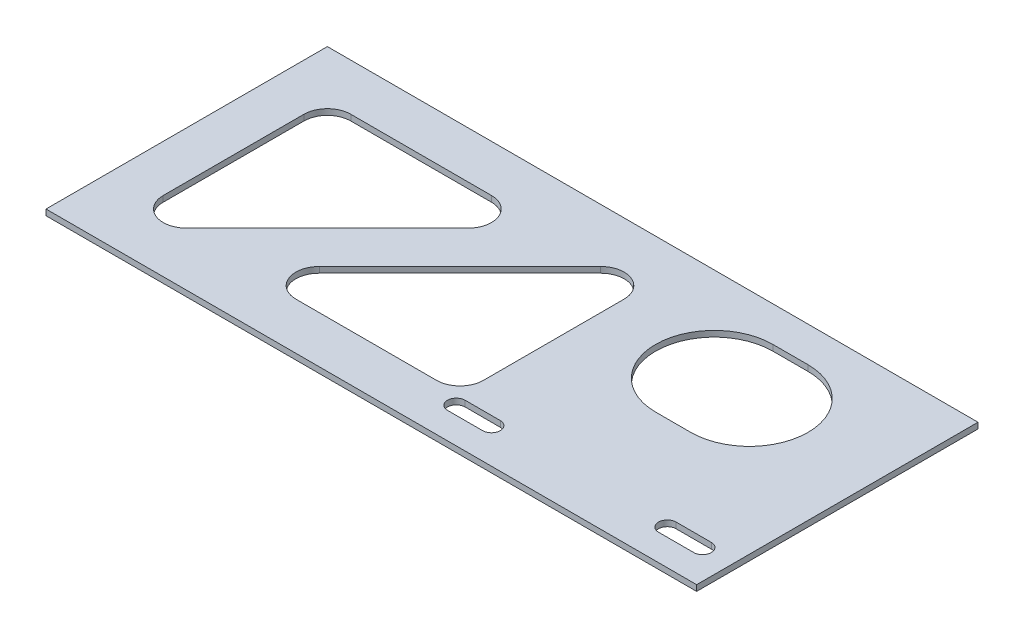
ISO-10303-21;
HEADER;
FILE_DESCRIPTION(('STEP AP214'),'2;1');
FILE_NAME('part.step','',(''),(''),'','','');
FILE_SCHEMA(('AUTOMOTIVE_DESIGN { 1 0 10303 214 1 1 1 1 }'));
ENDSEC;
DATA;
#1=APPLICATION_CONTEXT('core data for automotive mechanical design processes');
#2=APPLICATION_PROTOCOL_DEFINITION('international standard','automotive_design',2000,#1);
#3=PRODUCT_CONTEXT('',#1,'mechanical');
#4=PRODUCT('Part','Part','',(#3));
#5=PRODUCT_RELATED_PRODUCT_CATEGORY('part','',(#4));
#6=PRODUCT_DEFINITION_FORMATION('','',#4);
#7=PRODUCT_DEFINITION_CONTEXT('part definition',#1,'design');
#8=PRODUCT_DEFINITION('design','',#6,#7);
#9=PRODUCT_DEFINITION_SHAPE('','',#8);
#10=(LENGTH_UNIT() NAMED_UNIT(*) SI_UNIT(.MILLI.,.METRE.));
#11=(NAMED_UNIT(*) PLANE_ANGLE_UNIT() SI_UNIT($,.RADIAN.));
#12=(NAMED_UNIT(*) SI_UNIT($,.STERADIAN.) SOLID_ANGLE_UNIT());
#13=UNCERTAINTY_MEASURE_WITH_UNIT(LENGTH_MEASURE(1.E-05),#10,'distance_accuracy_value','');
#14=(GEOMETRIC_REPRESENTATION_CONTEXT(3) GLOBAL_UNCERTAINTY_ASSIGNED_CONTEXT((#13)) GLOBAL_UNIT_ASSIGNED_CONTEXT((#10,
#11,#12)) REPRESENTATION_CONTEXT('',''));
#15=CARTESIAN_POINT('',(0.,0.,0.));
#16=DIRECTION('',(0.,0.,1.));
#17=DIRECTION('',(1.,0.,0.));
#18=AXIS2_PLACEMENT_3D('',#15,#16,#17);
#19=CARTESIAN_POINT('',(-176.2125,1.58750000000001,76.2000000000001));
#20=DIRECTION('',(0.,-1.,0.));
#21=DIRECTION('',(0.,0.,-1.));
#22=AXIS2_PLACEMENT_3D('',#19,#20,#21);
#23=PLANE('',#22);
#24=DIRECTION('',(-1.,0.,0.));
#25=VECTOR('',#24,1.);
#26=CARTESIAN_POINT('',(46.0375,1.58750000000001,52.3875000000001));
#27=LINE('',#26,#25);
#28=CARTESIAN_POINT('',(46.0375,1.58750000000001,52.3875000000001));
#29=VERTEX_POINT('',#28);
#30=CARTESIAN_POINT('',(26.9875,1.58750000000001,52.3875000000001));
#31=VERTEX_POINT('',#30);
#32=EDGE_CURVE('E292',#29,#31,#27,.T.);
#33=ORIENTED_EDGE('',*,*,#32,.F.);
#34=CARTESIAN_POINT('',(46.0375,1.58750000000001,57.1500000000001));
#35=DIRECTION('',(0.,1.,0.));
#36=DIRECTION('',(0.,0.,1.));
#37=AXIS2_PLACEMENT_3D('',#34,#35,#36);
#38=CIRCLE('',#37,4.76249999999999);
#39=CARTESIAN_POINT('',(46.0375,1.58750000000001,61.9125000000001));
#40=VERTEX_POINT('',#39);
#41=EDGE_CURVE('E95',#40,#29,#38,.T.);
#42=ORIENTED_EDGE('',*,*,#41,.F.);
#43=DIRECTION('',(1.,0.,0.));
#44=VECTOR('',#43,1.);
#45=CARTESIAN_POINT('',(46.0375,1.58750000000001,61.9125000000001));
#46=LINE('',#45,#44);
#47=CARTESIAN_POINT('',(26.9875,1.58750000000001,61.9125000000001));
#48=VERTEX_POINT('',#47);
#49=EDGE_CURVE('E283',#48,#40,#46,.T.);
#50=ORIENTED_EDGE('',*,*,#49,.F.);
#51=CARTESIAN_POINT('',(26.9875,1.58750000000001,57.1500000000001));
#52=DIRECTION('',(0.,1.,0.));
#53=DIRECTION('',(0.,0.,1.));
#54=AXIS2_PLACEMENT_3D('',#51,#52,#53);
#55=CIRCLE('',#54,4.76249999999999);
#56=EDGE_CURVE('E286',#31,#48,#55,.T.);
#57=ORIENTED_EDGE('',*,*,#56,.F.);
#58=EDGE_LOOP('',(#33,#42,#50,#57));
#59=FACE_BOUND('',#58,.T.);
#60=DIRECTION('',(-1.,0.,0.));
#61=VECTOR('',#60,1.);
#62=CARTESIAN_POINT('',(160.3375,1.58750000000001,52.3875000000001));
#63=LINE('',#62,#61);
#64=CARTESIAN_POINT('',(160.3375,1.58750000000001,52.3875000000001));
#65=VERTEX_POINT('',#64);
#66=CARTESIAN_POINT('',(141.2875,1.58750000000001,52.3875000000001));
#67=VERTEX_POINT('',#66);
#68=EDGE_CURVE('E317',#65,#67,#63,.T.);
#69=ORIENTED_EDGE('',*,*,#68,.F.);
#70=CARTESIAN_POINT('',(160.3375,1.58750000000001,57.1500000000001));
#71=DIRECTION('',(0.,1.,0.));
#72=DIRECTION('',(0.,0.,1.));
#73=AXIS2_PLACEMENT_3D('',#70,#71,#72);
#74=CIRCLE('',#73,4.7625);
#75=CARTESIAN_POINT('',(160.3375,1.58750000000001,61.9125000000001));
#76=VERTEX_POINT('',#75);
#77=EDGE_CURVE('E298',#76,#65,#74,.T.);
#78=ORIENTED_EDGE('',*,*,#77,.F.);
#79=DIRECTION('',(1.,0.,0.));
#80=VECTOR('',#79,1.);
#81=CARTESIAN_POINT('',(160.3375,1.58750000000001,61.9125000000001));
#82=LINE('',#81,#80);
#83=CARTESIAN_POINT('',(141.2875,1.58750000000001,61.9125000000001));
#84=VERTEX_POINT('',#83);
#85=EDGE_CURVE('E306',#84,#76,#82,.T.);
#86=ORIENTED_EDGE('',*,*,#85,.F.);
#87=CARTESIAN_POINT('',(141.2875,1.58750000000001,57.1500000000001));
#88=DIRECTION('',(0.,1.,0.));
#89=DIRECTION('',(0.,0.,1.));
#90=AXIS2_PLACEMENT_3D('',#87,#88,#89);
#91=CIRCLE('',#90,4.7625);
#92=EDGE_CURVE('E320',#67,#84,#91,.T.);
#93=ORIENTED_EDGE('',*,*,#92,.F.);
#94=EDGE_LOOP('',(#69,#78,#86,#93));
#95=FACE_BOUND('',#94,.T.);
#96=DIRECTION('',(0.,0.,1.));
#97=VECTOR('',#96,1.);
#98=CARTESIAN_POINT('',(-176.2125,1.58750000000001,-76.1999999999999));
#99=LINE('',#98,#97);
#100=CARTESIAN_POINT('',(-176.2125,1.58750000000001,-76.1999999999999));
#101=VERTEX_POINT('',#100);
#102=CARTESIAN_POINT('',(-176.2125,1.58750000000001,76.2000000000001));
#103=VERTEX_POINT('',#102);
#104=EDGE_CURVE('E459',#101,#103,#99,.T.);
#105=ORIENTED_EDGE('',*,*,#104,.T.);
#106=DIRECTION('',(1.,0.,0.));
#107=VECTOR('',#106,1.);
#108=CARTESIAN_POINT('',(176.2125,1.58750000000001,76.2));
#109=LINE('',#108,#107);
#110=CARTESIAN_POINT('',(176.2125,1.58750000000001,76.2));
#111=VERTEX_POINT('',#110);
#112=EDGE_CURVE('E462',#103,#111,#109,.T.);
#113=ORIENTED_EDGE('',*,*,#112,.T.);
#114=DIRECTION('',(0.,0.,-1.));
#115=VECTOR('',#114,1.);
#116=CARTESIAN_POINT('',(176.2125,1.58750000000001,-76.2));
#117=LINE('',#116,#115);
#118=CARTESIAN_POINT('',(176.2125,1.58750000000001,-76.2));
#119=VERTEX_POINT('',#118);
#120=EDGE_CURVE('E465',#111,#119,#117,.T.);
#121=ORIENTED_EDGE('',*,*,#120,.T.);
#122=DIRECTION('',(-1.,0.,0.));
#123=VECTOR('',#122,1.);
#124=CARTESIAN_POINT('',(176.2125,1.58750000000001,-76.2));
#125=LINE('',#124,#123);
#126=EDGE_CURVE('E467',#119,#101,#125,.T.);
#127=ORIENTED_EDGE('',*,*,#126,.T.);
#128=EDGE_LOOP('',(#105,#113,#121,#127));
#129=FACE_BOUND('',#128,.T.);
#130=CARTESIAN_POINT('',(84.1375,1.58750000000001,-25.4));
#131=DIRECTION('',(0.,1.,0.));
#132=DIRECTION('',(0.,0.,1.));
#133=AXIS2_PLACEMENT_3D('',#130,#131,#132);
#134=CIRCLE('',#133,31.75);
#135=CARTESIAN_POINT('',(84.1375,1.58750000000001,-57.15));
#136=VERTEX_POINT('',#135);
#137=CARTESIAN_POINT('',(84.1375,1.58750000000001,6.35000000000001));
#138=VERTEX_POINT('',#137);
#139=EDGE_CURVE('E442',#136,#138,#134,.T.);
#140=ORIENTED_EDGE('',*,*,#139,.F.);
#141=DIRECTION('',(-1.,0.,0.));
#142=VECTOR('',#141,1.);
#143=CARTESIAN_POINT('',(-298.796121768143,1.58750000000001,-57.1499999999999));
#144=LINE('',#143,#142);
#145=CARTESIAN_POINT('',(103.1875,1.58750000000001,-57.15));
#146=VERTEX_POINT('',#145);
#147=EDGE_CURVE('E416',#146,#136,#144,.T.);
#148=ORIENTED_EDGE('',*,*,#147,.F.);
#149=CARTESIAN_POINT('',(103.1875,1.58750000000001,-25.4));
#150=DIRECTION('',(0.,1.,0.));
#151=DIRECTION('',(0.,0.,1.));
#152=AXIS2_PLACEMENT_3D('',#149,#150,#151);
#153=CIRCLE('',#152,31.75);
#154=CARTESIAN_POINT('',(103.1875,1.58750000000001,6.35000000000002));
#155=VERTEX_POINT('',#154);
#156=EDGE_CURVE('E431',#155,#146,#153,.T.);
#157=ORIENTED_EDGE('',*,*,#156,.F.);
#158=DIRECTION('',(-1.,0.,0.));
#159=VECTOR('',#158,1.);
#160=CARTESIAN_POINT('',(-298.796121768143,1.58750000000001,6.34999999999999));
#161=LINE('',#160,#159);
#162=EDGE_CURVE('E445',#155,#138,#161,.T.);
#163=ORIENTED_EDGE('',*,*,#162,.T.);
#164=EDGE_LOOP('',(#140,#148,#157,#163));
#165=FACE_BOUND('',#164,.T.);
#166=CARTESIAN_POINT('',(-66.2704510314472,1.58750000000001,38.1000000000001));
#167=DIRECTION('',(0.,1.,0.));
#168=DIRECTION('',(0.,0.,1.));
#169=AXIS2_PLACEMENT_3D('',#166,#167,#168);
#170=CIRCLE('',#169,12.7);
#171=CARTESIAN_POINT('',(-75.2507071525164,1.58750000000001,29.1197438789309));
#172=VERTEX_POINT('',#171);
#173=CARTESIAN_POINT('',(-66.2704510314472,1.58750000000001,50.8000000000001));
#174=VERTEX_POINT('',#173);
#175=EDGE_CURVE('E400',#172,#174,#170,.T.);
#176=ORIENTED_EDGE('',*,*,#175,.F.);
#177=DIRECTION('',(-0.707106781186544,0.,0.707106781186551));
#178=VECTOR('',#177,1.);
#179=CARTESIAN_POINT('',(-172.463542520863,1.58750000000001,126.332579247279));
#180=LINE('',#179,#178);
#181=CARTESIAN_POINT('',(0.949292847482852,1.58750000000001,-47.0802561210691));
#182=VERTEX_POINT('',#181);
#183=EDGE_CURVE('E368',#182,#172,#180,.T.);
#184=ORIENTED_EDGE('',*,*,#183,.F.);
#185=CARTESIAN_POINT('',(9.92954896855206,1.58750000000001,-38.1));
#186=DIRECTION('',(0.,1.,0.));
#187=DIRECTION('',(0.,0.,1.));
#188=AXIS2_PLACEMENT_3D('',#185,#186,#187);
#189=CIRCLE('',#188,12.7);
#190=CARTESIAN_POINT('',(22.6295489685521,1.58750000000001,-38.1));
#191=VERTEX_POINT('',#190);
#192=EDGE_CURVE('E383',#191,#182,#189,.T.);
#193=ORIENTED_EDGE('',*,*,#192,.F.);
#194=DIRECTION('',(0.,0.,-1.));
#195=VECTOR('',#194,1.);
#196=CARTESIAN_POINT('',(22.6295489685521,1.58750000000001,0.));
#197=LINE('',#196,#195);
#198=CARTESIAN_POINT('',(22.6295489685521,1.58750000000001,38.1000000000001));
#199=VERTEX_POINT('',#198);
#200=EDGE_CURVE('E409',#199,#191,#197,.T.);
#201=ORIENTED_EDGE('',*,*,#200,.F.);
#202=CARTESIAN_POINT('',(9.92954896855206,1.58750000000001,38.1000000000001));
#203=DIRECTION('',(0.,1.,0.));
#204=DIRECTION('',(0.,0.,1.));
#205=AXIS2_PLACEMENT_3D('',#202,#203,#204);
#206=CIRCLE('',#205,12.7);
#207=CARTESIAN_POINT('',(9.92954896855208,1.58750000000001,50.8));
#208=VERTEX_POINT('',#207);
#209=EDGE_CURVE('E406',#208,#199,#206,.T.);
#210=ORIENTED_EDGE('',*,*,#209,.F.);
#211=DIRECTION('',(1.,0.,0.));
#212=VECTOR('',#211,1.);
#213=CARTESIAN_POINT('',(-298.796121768143,1.58750000000001,50.8000000000001));
#214=LINE('',#213,#212);
#215=EDGE_CURVE('E403',#174,#208,#214,.T.);
#216=ORIENTED_EDGE('',*,*,#215,.F.);
#217=EDGE_LOOP('',(#176,#184,#193,#201,#210,#216));
#218=FACE_BOUND('',#217,.T.);
#219=CARTESIAN_POINT('',(-138.1125,1.58750000000001,-38.1));
#220=DIRECTION('',(0.,1.,0.));
#221=DIRECTION('',(0.,0.,1.));
#222=AXIS2_PLACEMENT_3D('',#219,#220,#221);
#223=CIRCLE('',#222,12.7);
#224=CARTESIAN_POINT('',(-150.8125,1.58750000000001,-38.1));
#225=VERTEX_POINT('',#224);
#226=CARTESIAN_POINT('',(-138.1125,1.58750000000001,-50.8));
#227=VERTEX_POINT('',#226);
#228=EDGE_CURVE('E327',#225,#227,#223,.F.);
#229=ORIENTED_EDGE('',*,*,#228,.T.);
#230=DIRECTION('',(1.,0.,0.));
#231=VECTOR('',#230,1.);
#232=CARTESIAN_POINT('',(-298.796121768143,1.58750000000001,-50.8));
#233=LINE('',#232,#231);
#234=CARTESIAN_POINT('',(-61.9125000000008,1.58750000000001,-50.8));
#235=VERTEX_POINT('',#234);
#236=EDGE_CURVE('E337',#227,#235,#233,.T.);
#237=ORIENTED_EDGE('',*,*,#236,.T.);
#238=CARTESIAN_POINT('',(-61.9125000000008,1.58750000000001,-38.1));
#239=DIRECTION('',(0.,1.,0.));
#240=DIRECTION('',(0.,0.,1.));
#241=AXIS2_PLACEMENT_3D('',#238,#239,#240);
#242=CIRCLE('',#241,12.7);
#243=CARTESIAN_POINT('',(-52.9322438789316,1.58750000000001,-29.1197438789309));
#244=VERTEX_POINT('',#243);
#245=EDGE_CURVE('E360',#235,#244,#242,.F.);
#246=ORIENTED_EDGE('',*,*,#245,.T.);
#247=DIRECTION('',(-0.707106781186544,0.,0.707106781186551));
#248=VECTOR('',#247,1.);
#249=CARTESIAN_POINT('',(-190.424054763001,1.58750000000001,108.37206700514));
#250=LINE('',#249,#248);
#251=CARTESIAN_POINT('',(-129.132243878931,1.58750000000001,47.0802561210692));
#252=VERTEX_POINT('',#251);
#253=EDGE_CURVE('E357',#244,#252,#250,.T.);
#254=ORIENTED_EDGE('',*,*,#253,.T.);
#255=CARTESIAN_POINT('',(-138.1125,1.58750000000001,38.1000000000001));
#256=DIRECTION('',(0.,1.,0.));
#257=DIRECTION('',(0.,0.,1.));
#258=AXIS2_PLACEMENT_3D('',#255,#256,#257);
#259=CIRCLE('',#258,12.7);
#260=CARTESIAN_POINT('',(-150.8125,1.58750000000001,38.1000000000001));
#261=VERTEX_POINT('',#260);
#262=EDGE_CURVE('E354',#252,#261,#259,.F.);
#263=ORIENTED_EDGE('',*,*,#262,.T.);
#264=DIRECTION('',(0.,0.,-1.));
#265=VECTOR('',#264,1.);
#266=CARTESIAN_POINT('',(-150.8125,1.58750000000001,0.));
#267=LINE('',#266,#265);
#268=EDGE_CURVE('E351',#261,#225,#267,.T.);
#269=ORIENTED_EDGE('',*,*,#268,.T.);
#270=EDGE_LOOP('',(#229,#237,#246,#254,#263,#269));
#271=FACE_BOUND('',#270,.T.);
#272=ADVANCED_FACE('F80',(#59,#95,#129,#165,#218,#271),#23,.F.);
#273=CARTESIAN_POINT('',(-176.2125,-1.58750000000001,76.2000000000001));
#274=DIRECTION('',(0.,-1.,0.));
#275=DIRECTION('',(0.,0.,-1.));
#276=AXIS2_PLACEMENT_3D('',#273,#274,#275);
#277=PLANE('',#276);
#278=CARTESIAN_POINT('',(46.0375,-1.58750000000001,57.1500000000001));
#279=DIRECTION('',(0.,1.,0.));
#280=DIRECTION('',(0.,0.,1.));
#281=AXIS2_PLACEMENT_3D('',#278,#279,#280);
#282=CIRCLE('',#281,4.76249999999999);
#283=CARTESIAN_POINT('',(46.0375,-1.58750000000001,61.9125000000001));
#284=VERTEX_POINT('',#283);
#285=CARTESIAN_POINT('',(46.0375,-1.58750000000001,52.3875000000001));
#286=VERTEX_POINT('',#285);
#287=EDGE_CURVE('E267',#284,#286,#282,.T.);
#288=ORIENTED_EDGE('',*,*,#287,.T.);
#289=DIRECTION('',(-1.,0.,0.));
#290=VECTOR('',#289,1.);
#291=CARTESIAN_POINT('',(46.0375,-1.58750000000001,52.3875000000001));
#292=LINE('',#291,#290);
#293=CARTESIAN_POINT('',(26.9875,-1.58750000000001,52.3875000000001));
#294=VERTEX_POINT('',#293);
#295=EDGE_CURVE('E276',#286,#294,#292,.T.);
#296=ORIENTED_EDGE('',*,*,#295,.T.);
#297=CARTESIAN_POINT('',(26.9875,-1.58750000000001,57.1500000000001));
#298=DIRECTION('',(0.,1.,0.));
#299=DIRECTION('',(0.,0.,1.));
#300=AXIS2_PLACEMENT_3D('',#297,#298,#299);
#301=CIRCLE('',#300,4.76249999999999);
#302=CARTESIAN_POINT('',(26.9875,-1.58750000000001,61.9125000000001));
#303=VERTEX_POINT('',#302);
#304=EDGE_CURVE('E103',#294,#303,#301,.T.);
#305=ORIENTED_EDGE('',*,*,#304,.T.);
#306=DIRECTION('',(1.,0.,0.));
#307=VECTOR('',#306,1.);
#308=CARTESIAN_POINT('',(46.0375,-1.58750000000001,61.9125000000001));
#309=LINE('',#308,#307);
#310=EDGE_CURVE('E273',#303,#284,#309,.T.);
#311=ORIENTED_EDGE('',*,*,#310,.T.);
#312=EDGE_LOOP('',(#288,#296,#305,#311));
#313=FACE_BOUND('',#312,.T.);
#314=CARTESIAN_POINT('',(160.3375,-1.58750000000001,57.1500000000001));
#315=DIRECTION('',(0.,1.,0.));
#316=DIRECTION('',(0.,0.,1.));
#317=AXIS2_PLACEMENT_3D('',#314,#315,#316);
#318=CIRCLE('',#317,4.7625);
#319=CARTESIAN_POINT('',(160.3375,-1.58750000000001,61.9125000000001));
#320=VERTEX_POINT('',#319);
#321=CARTESIAN_POINT('',(160.3375,-1.58750000000001,52.3875000000001));
#322=VERTEX_POINT('',#321);
#323=EDGE_CURVE('E302',#320,#322,#318,.T.);
#324=ORIENTED_EDGE('',*,*,#323,.T.);
#325=DIRECTION('',(-1.,0.,0.));
#326=VECTOR('',#325,1.);
#327=CARTESIAN_POINT('',(160.3375,-1.58750000000001,52.3875000000001));
#328=LINE('',#327,#326);
#329=CARTESIAN_POINT('',(141.2875,-1.58750000000001,52.3875000000001));
#330=VERTEX_POINT('',#329);
#331=EDGE_CURVE('E305',#322,#330,#328,.T.);
#332=ORIENTED_EDGE('',*,*,#331,.T.);
#333=CARTESIAN_POINT('',(141.2875,-1.58750000000001,57.1500000000001));
#334=DIRECTION('',(0.,1.,0.));
#335=DIRECTION('',(0.,0.,1.));
#336=AXIS2_PLACEMENT_3D('',#333,#334,#335);
#337=CIRCLE('',#336,4.7625);
#338=CARTESIAN_POINT('',(141.2875,-1.58750000000001,61.9125000000001));
#339=VERTEX_POINT('',#338);
#340=EDGE_CURVE('E309',#330,#339,#337,.T.);
#341=ORIENTED_EDGE('',*,*,#340,.T.);
#342=DIRECTION('',(1.,0.,0.));
#343=VECTOR('',#342,1.);
#344=CARTESIAN_POINT('',(160.3375,-1.58750000000001,61.9125000000001));
#345=LINE('',#344,#343);
#346=EDGE_CURVE('E312',#339,#320,#345,.T.);
#347=ORIENTED_EDGE('',*,*,#346,.T.);
#348=EDGE_LOOP('',(#324,#332,#341,#347));
#349=FACE_BOUND('',#348,.T.);
#350=DIRECTION('',(0.,0.,1.));
#351=VECTOR('',#350,1.);
#352=CARTESIAN_POINT('',(-176.2125,-1.58750000000001,-76.1999999999999));
#353=LINE('',#352,#351);
#354=CARTESIAN_POINT('',(-176.2125,-1.58750000000001,-76.1999999999999));
#355=VERTEX_POINT('',#354);
#356=CARTESIAN_POINT('',(-176.2125,-1.58750000000001,76.2000000000001));
#357=VERTEX_POINT('',#356);
#358=EDGE_CURVE('E452',#355,#357,#353,.T.);
#359=ORIENTED_EDGE('',*,*,#358,.F.);
#360=DIRECTION('',(-1.,0.,0.));
#361=VECTOR('',#360,1.);
#362=CARTESIAN_POINT('',(176.2125,-1.58750000000001,-76.2));
#363=LINE('',#362,#361);
#364=CARTESIAN_POINT('',(176.2125,-1.58750000000001,-76.2));
#365=VERTEX_POINT('',#364);
#366=EDGE_CURVE('E463',#365,#355,#363,.T.);
#367=ORIENTED_EDGE('',*,*,#366,.F.);
#368=DIRECTION('',(0.,0.,-1.));
#369=VECTOR('',#368,1.);
#370=CARTESIAN_POINT('',(176.2125,-1.58750000000001,-76.2));
#371=LINE('',#370,#369);
#372=CARTESIAN_POINT('',(176.2125,-1.58750000000001,76.2));
#373=VERTEX_POINT('',#372);
#374=EDGE_CURVE('E474',#373,#365,#371,.T.);
#375=ORIENTED_EDGE('',*,*,#374,.F.);
#376=DIRECTION('',(1.,0.,0.));
#377=VECTOR('',#376,1.);
#378=CARTESIAN_POINT('',(176.2125,-1.58750000000001,76.2));
#379=LINE('',#378,#377);
#380=EDGE_CURVE('E472',#357,#373,#379,.T.);
#381=ORIENTED_EDGE('',*,*,#380,.F.);
#382=EDGE_LOOP('',(#359,#367,#375,#381));
#383=FACE_BOUND('',#382,.T.);
#384=DIRECTION('',(-1.,0.,0.));
#385=VECTOR('',#384,1.);
#386=CARTESIAN_POINT('',(-298.796121768143,-1.58750000000001,-57.1499999999999));
#387=LINE('',#386,#385);
#388=CARTESIAN_POINT('',(103.1875,-1.58750000000001,-57.15));
#389=VERTEX_POINT('',#388);
#390=CARTESIAN_POINT('',(84.1375,-1.58750000000001,-57.15));
#391=VERTEX_POINT('',#390);
#392=EDGE_CURVE('E427',#389,#391,#387,.T.);
#393=ORIENTED_EDGE('',*,*,#392,.T.);
#394=CARTESIAN_POINT('',(84.1375,-1.58750000000001,-25.4));
#395=DIRECTION('',(0.,1.,0.));
#396=DIRECTION('',(0.,0.,1.));
#397=AXIS2_PLACEMENT_3D('',#394,#395,#396);
#398=CIRCLE('',#397,31.75);
#399=CARTESIAN_POINT('',(84.1375,-1.58750000000001,6.35000000000002));
#400=VERTEX_POINT('',#399);
#401=EDGE_CURVE('E430',#391,#400,#398,.T.);
#402=ORIENTED_EDGE('',*,*,#401,.T.);
#403=DIRECTION('',(-1.,0.,0.));
#404=VECTOR('',#403,1.);
#405=CARTESIAN_POINT('',(-298.796121768143,-1.58750000000001,6.34999999999999));
#406=LINE('',#405,#404);
#407=CARTESIAN_POINT('',(103.1875,-1.58750000000001,6.35000000000002));
#408=VERTEX_POINT('',#407);
#409=EDGE_CURVE('E434',#408,#400,#406,.T.);
#410=ORIENTED_EDGE('',*,*,#409,.F.);
#411=CARTESIAN_POINT('',(103.1875,-1.58750000000001,-25.4));
#412=DIRECTION('',(0.,1.,0.));
#413=DIRECTION('',(0.,0.,1.));
#414=AXIS2_PLACEMENT_3D('',#411,#412,#413);
#415=CIRCLE('',#414,31.75);
#416=EDGE_CURVE('E437',#408,#389,#415,.T.);
#417=ORIENTED_EDGE('',*,*,#416,.T.);
#418=EDGE_LOOP('',(#393,#402,#410,#417));
#419=FACE_BOUND('',#418,.T.);
#420=DIRECTION('',(-0.707106781186544,0.,0.707106781186551));
#421=VECTOR('',#420,1.);
#422=CARTESIAN_POINT('',(-172.463542520863,-1.58750000000001,126.332579247279));
#423=LINE('',#422,#421);
#424=CARTESIAN_POINT('',(0.949292847482852,-1.58750000000001,-47.0802561210691));
#425=VERTEX_POINT('',#424);
#426=CARTESIAN_POINT('',(-75.2507071525164,-1.58750000000001,29.119743878931));
#427=VERTEX_POINT('',#426);
#428=EDGE_CURVE('E379',#425,#427,#423,.T.);
#429=ORIENTED_EDGE('',*,*,#428,.T.);
#430=CARTESIAN_POINT('',(-66.2704510314472,-1.58750000000001,38.1000000000001));
#431=DIRECTION('',(0.,1.,0.));
#432=DIRECTION('',(0.,0.,1.));
#433=AXIS2_PLACEMENT_3D('',#430,#431,#432);
#434=CIRCLE('',#433,12.7);
#435=CARTESIAN_POINT('',(-66.2704510314472,-1.58750000000001,50.8000000000001));
#436=VERTEX_POINT('',#435);
#437=EDGE_CURVE('E382',#427,#436,#434,.T.);
#438=ORIENTED_EDGE('',*,*,#437,.T.);
#439=DIRECTION('',(1.,0.,0.));
#440=VECTOR('',#439,1.);
#441=CARTESIAN_POINT('',(-298.796121768143,-1.58750000000001,50.8000000000001));
#442=LINE('',#441,#440);
#443=CARTESIAN_POINT('',(9.92954896855208,-1.58750000000001,50.8));
#444=VERTEX_POINT('',#443);
#445=EDGE_CURVE('E386',#436,#444,#442,.T.);
#446=ORIENTED_EDGE('',*,*,#445,.T.);
#447=CARTESIAN_POINT('',(9.92954896855206,-1.58750000000001,38.1000000000001));
#448=DIRECTION('',(0.,1.,0.));
#449=DIRECTION('',(0.,0.,1.));
#450=AXIS2_PLACEMENT_3D('',#447,#448,#449);
#451=CIRCLE('',#450,12.7);
#452=CARTESIAN_POINT('',(22.6295489685521,-1.58750000000001,38.1000000000001));
#453=VERTEX_POINT('',#452);
#454=EDGE_CURVE('E389',#444,#453,#451,.T.);
#455=ORIENTED_EDGE('',*,*,#454,.T.);
#456=DIRECTION('',(0.,0.,-1.));
#457=VECTOR('',#456,1.);
#458=CARTESIAN_POINT('',(22.6295489685521,-1.58750000000001,0.));
#459=LINE('',#458,#457);
#460=CARTESIAN_POINT('',(22.6295489685521,-1.58750000000001,-38.1));
#461=VERTEX_POINT('',#460);
#462=EDGE_CURVE('E392',#453,#461,#459,.T.);
#463=ORIENTED_EDGE('',*,*,#462,.T.);
#464=CARTESIAN_POINT('',(9.92954896855206,-1.58750000000001,-38.1));
#465=DIRECTION('',(0.,1.,0.));
#466=DIRECTION('',(0.,0.,1.));
#467=AXIS2_PLACEMENT_3D('',#464,#465,#466);
#468=CIRCLE('',#467,12.7);
#469=EDGE_CURVE('E395',#461,#425,#468,.T.);
#470=ORIENTED_EDGE('',*,*,#469,.T.);
#471=EDGE_LOOP('',(#429,#438,#446,#455,#463,#470));
#472=FACE_BOUND('',#471,.T.);
#473=DIRECTION('',(1.,0.,0.));
#474=VECTOR('',#473,1.);
#475=CARTESIAN_POINT('',(-298.796121768143,-1.58750000000001,-50.8));
#476=LINE('',#475,#474);
#477=CARTESIAN_POINT('',(-138.1125,-1.58750000000001,-50.8));
#478=VERTEX_POINT('',#477);
#479=CARTESIAN_POINT('',(-61.9125000000008,-1.58750000000001,-50.8));
#480=VERTEX_POINT('',#479);
#481=EDGE_CURVE('E346',#478,#480,#476,.T.);
#482=ORIENTED_EDGE('',*,*,#481,.F.);
#483=CARTESIAN_POINT('',(-138.1125,-1.58750000000001,-38.1));
#484=DIRECTION('',(0.,1.,0.));
#485=DIRECTION('',(0.,0.,1.));
#486=AXIS2_PLACEMENT_3D('',#483,#484,#485);
#487=CIRCLE('',#486,12.7);
#488=CARTESIAN_POINT('',(-150.8125,-1.58750000000001,-38.1));
#489=VERTEX_POINT('',#488);
#490=EDGE_CURVE('E334',#489,#478,#487,.F.);
#491=ORIENTED_EDGE('',*,*,#490,.F.);
#492=DIRECTION('',(0.,0.,-1.));
#493=VECTOR('',#492,1.);
#494=CARTESIAN_POINT('',(-150.8125,-1.58750000000001,0.));
#495=LINE('',#494,#493);
#496=CARTESIAN_POINT('',(-150.8125,-1.58750000000001,38.1000000000001));
#497=VERTEX_POINT('',#496);
#498=EDGE_CURVE('E336',#497,#489,#495,.T.);
#499=ORIENTED_EDGE('',*,*,#498,.F.);
#500=CARTESIAN_POINT('',(-138.1125,-1.58750000000001,38.1000000000001));
#501=DIRECTION('',(0.,1.,0.));
#502=DIRECTION('',(0.,0.,1.));
#503=AXIS2_PLACEMENT_3D('',#500,#501,#502);
#504=CIRCLE('',#503,12.7);
#505=CARTESIAN_POINT('',(-129.132243878931,-1.58750000000001,47.0802561210692));
#506=VERTEX_POINT('',#505);
#507=EDGE_CURVE('E339',#506,#497,#504,.F.);
#508=ORIENTED_EDGE('',*,*,#507,.F.);
#509=DIRECTION('',(-0.707106781186544,0.,0.707106781186551));
#510=VECTOR('',#509,1.);
#511=CARTESIAN_POINT('',(-190.424054763001,-1.58750000000001,108.37206700514));
#512=LINE('',#511,#510);
#513=CARTESIAN_POINT('',(-52.9322438789316,-1.58750000000001,-29.1197438789309));
#514=VERTEX_POINT('',#513);
#515=EDGE_CURVE('E342',#514,#506,#512,.T.);
#516=ORIENTED_EDGE('',*,*,#515,.F.);
#517=CARTESIAN_POINT('',(-61.9125000000008,-1.58750000000001,-38.1));
#518=DIRECTION('',(0.,1.,0.));
#519=DIRECTION('',(0.,0.,1.));
#520=AXIS2_PLACEMENT_3D('',#517,#518,#519);
#521=CIRCLE('',#520,12.7);
#522=EDGE_CURVE('E344',#480,#514,#521,.F.);
#523=ORIENTED_EDGE('',*,*,#522,.F.);
#524=EDGE_LOOP('',(#482,#491,#499,#508,#516,#523));
#525=FACE_BOUND('',#524,.T.);
#526=ADVANCED_FACE('F280',(#313,#349,#383,#419,#472,#525),#277,.T.);
#527=CARTESIAN_POINT('',(-176.2125,1.58750000000001,-76.1999999999999));
#528=DIRECTION('',(1.,0.,0.));
#529=DIRECTION('',(0.,0.,-1.));
#530=AXIS2_PLACEMENT_3D('',#527,#528,#529);
#531=PLANE('',#530);
#532=ORIENTED_EDGE('',*,*,#358,.T.);
#533=DIRECTION('',(0.,-1.,0.));
#534=VECTOR('',#533,1.);
#535=CARTESIAN_POINT('',(-176.2125,1.58750000000001,76.2000000000001));
#536=LINE('',#535,#534);
#537=EDGE_CURVE('E14',#103,#357,#536,.T.);
#538=ORIENTED_EDGE('',*,*,#537,.F.);
#539=ORIENTED_EDGE('',*,*,#104,.F.);
#540=DIRECTION('',(0.,-1.,0.));
#541=VECTOR('',#540,1.);
#542=CARTESIAN_POINT('',(-176.2125,1.58750000000001,-76.1999999999999));
#543=LINE('',#542,#541);
#544=EDGE_CURVE('E469',#101,#355,#543,.T.);
#545=ORIENTED_EDGE('',*,*,#544,.T.);
#546=EDGE_LOOP('',(#532,#538,#539,#545));
#547=FACE_BOUND('',#546,.T.);
#548=ADVANCED_FACE('F82',(#547),#531,.F.);
#549=CARTESIAN_POINT('',(176.2125,1.58750000000001,76.2));
#550=DIRECTION('',(0.,0.,-1.));
#551=DIRECTION('',(-1.,0.,0.));
#552=AXIS2_PLACEMENT_3D('',#549,#550,#551);
#553=PLANE('',#552);
#554=ORIENTED_EDGE('',*,*,#380,.T.);
#555=DIRECTION('',(0.,-1.,0.));
#556=VECTOR('',#555,1.);
#557=CARTESIAN_POINT('',(176.2125,1.58750000000001,76.2));
#558=LINE('',#557,#556);
#559=EDGE_CURVE('E88',#111,#373,#558,.T.);
#560=ORIENTED_EDGE('',*,*,#559,.F.);
#561=ORIENTED_EDGE('',*,*,#112,.F.);
#562=ORIENTED_EDGE('',*,*,#537,.T.);
#563=EDGE_LOOP('',(#554,#560,#561,#562));
#564=FACE_BOUND('',#563,.T.);
#565=ADVANCED_FACE('F502',(#564),#553,.F.);
#566=CARTESIAN_POINT('',(176.2125,1.58750000000001,-76.2));
#567=DIRECTION('',(-1.,0.,0.));
#568=DIRECTION('',(0.,0.,1.));
#569=AXIS2_PLACEMENT_3D('',#566,#567,#568);
#570=PLANE('',#569);
#571=ORIENTED_EDGE('',*,*,#374,.T.);
#572=DIRECTION('',(0.,-1.,0.));
#573=VECTOR('',#572,1.);
#574=CARTESIAN_POINT('',(176.2125,1.58750000000001,-76.2));
#575=LINE('',#574,#573);
#576=EDGE_CURVE('E479',#119,#365,#575,.T.);
#577=ORIENTED_EDGE('',*,*,#576,.F.);
#578=ORIENTED_EDGE('',*,*,#120,.F.);
#579=ORIENTED_EDGE('',*,*,#559,.T.);
#580=EDGE_LOOP('',(#571,#577,#578,#579));
#581=FACE_BOUND('',#580,.T.);
#582=ADVANCED_FACE('F486',(#581),#570,.F.);
#583=CARTESIAN_POINT('',(176.2125,1.58750000000001,-76.2));
#584=DIRECTION('',(0.,0.,1.));
#585=DIRECTION('',(1.,0.,0.));
#586=AXIS2_PLACEMENT_3D('',#583,#584,#585);
#587=PLANE('',#586);
#588=ORIENTED_EDGE('',*,*,#366,.T.);
#589=ORIENTED_EDGE('',*,*,#544,.F.);
#590=ORIENTED_EDGE('',*,*,#126,.F.);
#591=ORIENTED_EDGE('',*,*,#576,.T.);
#592=EDGE_LOOP('',(#588,#589,#590,#591));
#593=FACE_BOUND('',#592,.T.);
#594=ADVANCED_FACE('F495',(#593),#587,.F.);
#595=CARTESIAN_POINT('',(-298.796121768143,-1.58750000000001,-57.1499999999999));
#596=DIRECTION('',(0.,0.,-1.));
#597=DIRECTION('',(-1.,0.,0.));
#598=AXIS2_PLACEMENT_3D('',#595,#596,#597);
#599=PLANE('',#598);
#600=ORIENTED_EDGE('',*,*,#147,.T.);
#601=DIRECTION('',(0.,1.,0.));
#602=VECTOR('',#601,1.);
#603=CARTESIAN_POINT('',(84.1375,-1.58750000000001,-57.15));
#604=LINE('',#603,#602);
#605=EDGE_CURVE('E440',#391,#136,#604,.T.);
#606=ORIENTED_EDGE('',*,*,#605,.F.);
#607=ORIENTED_EDGE('',*,*,#392,.F.);
#608=DIRECTION('',(0.,1.,0.));
#609=VECTOR('',#608,1.);
#610=CARTESIAN_POINT('',(103.1875,-1.58750000000001,-57.15));
#611=LINE('',#610,#609);
#612=EDGE_CURVE('E450',#389,#146,#611,.T.);
#613=ORIENTED_EDGE('',*,*,#612,.T.);
#614=EDGE_LOOP('',(#600,#606,#607,#613));
#615=FACE_BOUND('',#614,.T.);
#616=ADVANCED_FACE('F518',(#615),#599,.F.);
#617=CARTESIAN_POINT('',(103.1875,-1.58750000000001,-25.4));
#618=DIRECTION('',(0.,1.,0.));
#619=DIRECTION('',(0.,0.,1.));
#620=AXIS2_PLACEMENT_3D('',#617,#618,#619);
#621=CYLINDRICAL_SURFACE('',#620,31.75);
#622=ORIENTED_EDGE('',*,*,#156,.T.);
#623=ORIENTED_EDGE('',*,*,#612,.F.);
#624=ORIENTED_EDGE('',*,*,#416,.F.);
#625=DIRECTION('',(0.,1.,0.));
#626=VECTOR('',#625,1.);
#627=CARTESIAN_POINT('',(103.1875,-1.58750000000001,6.35000000000002));
#628=LINE('',#627,#626);
#629=EDGE_CURVE('E453',#408,#155,#628,.T.);
#630=ORIENTED_EDGE('',*,*,#629,.T.);
#631=EDGE_LOOP('',(#622,#623,#624,#630));
#632=FACE_BOUND('',#631,.T.);
#633=ADVANCED_FACE('F525',(#632),#621,.F.);
#634=CARTESIAN_POINT('',(-298.796121768143,-1.58750000000001,6.34999999999999));
#635=DIRECTION('',(0.,0.,-1.));
#636=DIRECTION('',(-1.,0.,0.));
#637=AXIS2_PLACEMENT_3D('',#634,#635,#636);
#638=PLANE('',#637);
#639=ORIENTED_EDGE('',*,*,#162,.F.);
#640=ORIENTED_EDGE('',*,*,#629,.F.);
#641=ORIENTED_EDGE('',*,*,#409,.T.);
#642=DIRECTION('',(0.,1.,0.));
#643=VECTOR('',#642,1.);
#644=CARTESIAN_POINT('',(84.1375,-1.58750000000001,6.35000000000001));
#645=LINE('',#644,#643);
#646=EDGE_CURVE('E455',#400,#138,#645,.T.);
#647=ORIENTED_EDGE('',*,*,#646,.T.);
#648=EDGE_LOOP('',(#639,#640,#641,#647));
#649=FACE_BOUND('',#648,.T.);
#650=ADVANCED_FACE('F530',(#649),#638,.T.);
#651=CARTESIAN_POINT('',(84.1375,-1.58750000000001,-25.4));
#652=DIRECTION('',(0.,1.,0.));
#653=DIRECTION('',(0.,0.,1.));
#654=AXIS2_PLACEMENT_3D('',#651,#652,#653);
#655=CYLINDRICAL_SURFACE('',#654,31.75);
#656=ORIENTED_EDGE('',*,*,#139,.T.);
#657=ORIENTED_EDGE('',*,*,#646,.F.);
#658=ORIENTED_EDGE('',*,*,#401,.F.);
#659=ORIENTED_EDGE('',*,*,#605,.T.);
#660=EDGE_LOOP('',(#656,#657,#658,#659));
#661=FACE_BOUND('',#660,.T.);
#662=ADVANCED_FACE('F539',(#661),#655,.F.);
#663=CARTESIAN_POINT('',(-172.463542520863,-1.58750000000001,126.332579247279));
#664=DIRECTION('',(-0.707106781186551,0.,-0.707106781186544));
#665=DIRECTION('',(-0.707106781186544,0.,0.707106781186551));
#666=AXIS2_PLACEMENT_3D('',#663,#664,#665);
#667=PLANE('',#666);
#668=ORIENTED_EDGE('',*,*,#183,.T.);
#669=DIRECTION('',(0.,1.,0.));
#670=VECTOR('',#669,1.);
#671=CARTESIAN_POINT('',(-75.2507071525164,-1.58750000000001,29.119743878931));
#672=LINE('',#671,#670);
#673=EDGE_CURVE('E398',#427,#172,#672,.T.);
#674=ORIENTED_EDGE('',*,*,#673,.F.);
#675=ORIENTED_EDGE('',*,*,#428,.F.);
#676=DIRECTION('',(0.,1.,0.));
#677=VECTOR('',#676,1.);
#678=CARTESIAN_POINT('',(0.949292847482852,-1.58750000000001,-47.0802561210691));
#679=LINE('',#678,#677);
#680=EDGE_CURVE('E414',#425,#182,#679,.T.);
#681=ORIENTED_EDGE('',*,*,#680,.T.);
#682=EDGE_LOOP('',(#668,#674,#675,#681));
#683=FACE_BOUND('',#682,.T.);
#684=ADVANCED_FACE('F596',(#683),#667,.F.);
#685=CARTESIAN_POINT('',(9.92954896855206,-1.58750000000001,-38.1));
#686=DIRECTION('',(0.,1.,0.));
#687=DIRECTION('',(0.,0.,1.));
#688=AXIS2_PLACEMENT_3D('',#685,#686,#687);
#689=CYLINDRICAL_SURFACE('',#688,12.7);
#690=ORIENTED_EDGE('',*,*,#192,.T.);
#691=ORIENTED_EDGE('',*,*,#680,.F.);
#692=ORIENTED_EDGE('',*,*,#469,.F.);
#693=DIRECTION('',(0.,1.,0.));
#694=VECTOR('',#693,1.);
#695=CARTESIAN_POINT('',(22.6295489685521,-1.58750000000001,-38.1));
#696=LINE('',#695,#694);
#697=EDGE_CURVE('E417',#461,#191,#696,.T.);
#698=ORIENTED_EDGE('',*,*,#697,.T.);
#699=EDGE_LOOP('',(#690,#691,#692,#698));
#700=FACE_BOUND('',#699,.T.);
#701=ADVANCED_FACE('F592',(#700),#689,.F.);
#702=CARTESIAN_POINT('',(22.6295489685521,-1.58750000000001,0.));
#703=DIRECTION('',(1.,0.,0.));
#704=DIRECTION('',(0.,0.,-1.));
#705=AXIS2_PLACEMENT_3D('',#702,#703,#704);
#706=PLANE('',#705);
#707=ORIENTED_EDGE('',*,*,#200,.T.);
#708=ORIENTED_EDGE('',*,*,#697,.F.);
#709=ORIENTED_EDGE('',*,*,#462,.F.);
#710=DIRECTION('',(0.,1.,0.));
#711=VECTOR('',#710,1.);
#712=CARTESIAN_POINT('',(22.6295489685521,-1.58750000000001,38.1000000000001));
#713=LINE('',#712,#711);
#714=EDGE_CURVE('E419',#453,#199,#713,.T.);
#715=ORIENTED_EDGE('',*,*,#714,.T.);
#716=EDGE_LOOP('',(#707,#708,#709,#715));
#717=FACE_BOUND('',#716,.T.);
#718=ADVANCED_FACE('F595',(#717),#706,.F.);
#719=CARTESIAN_POINT('',(9.92954896855206,-1.58750000000001,38.1000000000001));
#720=DIRECTION('',(0.,1.,0.));
#721=DIRECTION('',(0.,0.,1.));
#722=AXIS2_PLACEMENT_3D('',#719,#720,#721);
#723=CYLINDRICAL_SURFACE('',#722,12.7);
#724=ORIENTED_EDGE('',*,*,#209,.T.);
#725=ORIENTED_EDGE('',*,*,#714,.F.);
#726=ORIENTED_EDGE('',*,*,#454,.F.);
#727=DIRECTION('',(0.,1.,0.));
#728=VECTOR('',#727,1.);
#729=CARTESIAN_POINT('',(9.92954896855208,-1.58750000000001,50.8));
#730=LINE('',#729,#728);
#731=EDGE_CURVE('E421',#444,#208,#730,.T.);
#732=ORIENTED_EDGE('',*,*,#731,.T.);
#733=EDGE_LOOP('',(#724,#725,#726,#732));
#734=FACE_BOUND('',#733,.T.);
#735=ADVANCED_FACE('F600',(#734),#723,.F.);
#736=CARTESIAN_POINT('',(-298.796121768143,-1.58750000000001,50.8000000000001));
#737=DIRECTION('',(0.,0.,1.));
#738=DIRECTION('',(1.,0.,0.));
#739=AXIS2_PLACEMENT_3D('',#736,#737,#738);
#740=PLANE('',#739);
#741=ORIENTED_EDGE('',*,*,#215,.T.);
#742=ORIENTED_EDGE('',*,*,#731,.F.);
#743=ORIENTED_EDGE('',*,*,#445,.F.);
#744=DIRECTION('',(0.,1.,0.));
#745=VECTOR('',#744,1.);
#746=CARTESIAN_POINT('',(-66.2704510314472,-1.58750000000001,50.8000000000001));
#747=LINE('',#746,#745);
#748=EDGE_CURVE('E423',#436,#174,#747,.T.);
#749=ORIENTED_EDGE('',*,*,#748,.T.);
#750=EDGE_LOOP('',(#741,#742,#743,#749));
#751=FACE_BOUND('',#750,.T.);
#752=ADVANCED_FACE('F604',(#751),#740,.F.);
#753=CARTESIAN_POINT('',(-66.2704510314472,-1.58750000000001,38.1000000000001));
#754=DIRECTION('',(0.,1.,0.));
#755=DIRECTION('',(0.,0.,1.));
#756=AXIS2_PLACEMENT_3D('',#753,#754,#755);
#757=CYLINDRICAL_SURFACE('',#756,12.7);
#758=ORIENTED_EDGE('',*,*,#175,.T.);
#759=ORIENTED_EDGE('',*,*,#748,.F.);
#760=ORIENTED_EDGE('',*,*,#437,.F.);
#761=ORIENTED_EDGE('',*,*,#673,.T.);
#762=EDGE_LOOP('',(#758,#759,#760,#761));
#763=FACE_BOUND('',#762,.T.);
#764=ADVANCED_FACE('F591',(#763),#757,.F.);
#765=CARTESIAN_POINT('',(-138.1125,-1.58750000000001,-38.1));
#766=DIRECTION('',(0.,1.,0.));
#767=DIRECTION('',(0.,0.,1.));
#768=AXIS2_PLACEMENT_3D('',#765,#766,#767);
#769=CYLINDRICAL_SURFACE('',#768,12.7);
#770=ORIENTED_EDGE('',*,*,#228,.F.);
#771=DIRECTION('',(0.,1.,0.));
#772=VECTOR('',#771,1.);
#773=CARTESIAN_POINT('',(-150.8125,-1.58750000000001,-38.1));
#774=LINE('',#773,#772);
#775=EDGE_CURVE('E348',#489,#225,#774,.T.);
#776=ORIENTED_EDGE('',*,*,#775,.F.);
#777=ORIENTED_EDGE('',*,*,#490,.T.);
#778=DIRECTION('',(0.,1.,0.));
#779=VECTOR('',#778,1.);
#780=CARTESIAN_POINT('',(-138.1125,-1.58750000000001,-50.8));
#781=LINE('',#780,#779);
#782=EDGE_CURVE('E365',#478,#227,#781,.T.);
#783=ORIENTED_EDGE('',*,*,#782,.T.);
#784=EDGE_LOOP('',(#770,#776,#777,#783));
#785=FACE_BOUND('',#784,.T.);
#786=ADVANCED_FACE('F564',(#785),#769,.F.);
#787=CARTESIAN_POINT('',(-298.796121768143,-1.58750000000001,-50.8));
#788=DIRECTION('',(0.,0.,1.));
#789=DIRECTION('',(1.,0.,0.));
#790=AXIS2_PLACEMENT_3D('',#787,#788,#789);
#791=PLANE('',#790);
#792=ORIENTED_EDGE('',*,*,#236,.F.);
#793=ORIENTED_EDGE('',*,*,#782,.F.);
#794=ORIENTED_EDGE('',*,*,#481,.T.);
#795=DIRECTION('',(0.,1.,0.));
#796=VECTOR('',#795,1.);
#797=CARTESIAN_POINT('',(-61.9125000000008,-1.58750000000001,-50.8));
#798=LINE('',#797,#796);
#799=EDGE_CURVE('E369',#480,#235,#798,.T.);
#800=ORIENTED_EDGE('',*,*,#799,.T.);
#801=EDGE_LOOP('',(#792,#793,#794,#800));
#802=FACE_BOUND('',#801,.T.);
#803=ADVANCED_FACE('F556',(#802),#791,.T.);
#804=CARTESIAN_POINT('',(-61.9125000000008,-1.58750000000001,-38.1));
#805=DIRECTION('',(0.,1.,0.));
#806=DIRECTION('',(0.,0.,1.));
#807=AXIS2_PLACEMENT_3D('',#804,#805,#806);
#808=CYLINDRICAL_SURFACE('',#807,12.7);
#809=ORIENTED_EDGE('',*,*,#245,.F.);
#810=ORIENTED_EDGE('',*,*,#799,.F.);
#811=ORIENTED_EDGE('',*,*,#522,.T.);
#812=DIRECTION('',(0.,1.,0.));
#813=VECTOR('',#812,1.);
#814=CARTESIAN_POINT('',(-52.9322438789316,-1.58750000000001,-29.1197438789309));
#815=LINE('',#814,#813);
#816=EDGE_CURVE('E371',#514,#244,#815,.T.);
#817=ORIENTED_EDGE('',*,*,#816,.T.);
#818=EDGE_LOOP('',(#809,#810,#811,#817));
#819=FACE_BOUND('',#818,.T.);
#820=ADVANCED_FACE('F559',(#819),#808,.F.);
#821=CARTESIAN_POINT('',(-190.424054763001,-1.58750000000001,108.37206700514));
#822=DIRECTION('',(-0.707106781186551,0.,-0.707106781186544));
#823=DIRECTION('',(-0.707106781186544,0.,0.707106781186551));
#824=AXIS2_PLACEMENT_3D('',#821,#822,#823);
#825=PLANE('',#824);
#826=ORIENTED_EDGE('',*,*,#253,.F.);
#827=ORIENTED_EDGE('',*,*,#816,.F.);
#828=ORIENTED_EDGE('',*,*,#515,.T.);
#829=DIRECTION('',(0.,1.,0.));
#830=VECTOR('',#829,1.);
#831=CARTESIAN_POINT('',(-129.132243878931,-1.58750000000001,47.0802561210692));
#832=LINE('',#831,#830);
#833=EDGE_CURVE('E373',#506,#252,#832,.T.);
#834=ORIENTED_EDGE('',*,*,#833,.T.);
#835=EDGE_LOOP('',(#826,#827,#828,#834));
#836=FACE_BOUND('',#835,.T.);
#837=ADVANCED_FACE('F575',(#836),#825,.T.);
#838=CARTESIAN_POINT('',(-138.1125,-1.58750000000001,38.1000000000001));
#839=DIRECTION('',(0.,1.,0.));
#840=DIRECTION('',(0.,0.,1.));
#841=AXIS2_PLACEMENT_3D('',#838,#839,#840);
#842=CYLINDRICAL_SURFACE('',#841,12.7);
#843=ORIENTED_EDGE('',*,*,#262,.F.);
#844=ORIENTED_EDGE('',*,*,#833,.F.);
#845=ORIENTED_EDGE('',*,*,#507,.T.);
#846=DIRECTION('',(0.,1.,0.));
#847=VECTOR('',#846,1.);
#848=CARTESIAN_POINT('',(-150.8125,-1.58750000000001,38.1000000000001));
#849=LINE('',#848,#847);
#850=EDGE_CURVE('E375',#497,#261,#849,.T.);
#851=ORIENTED_EDGE('',*,*,#850,.T.);
#852=EDGE_LOOP('',(#843,#844,#845,#851));
#853=FACE_BOUND('',#852,.T.);
#854=ADVANCED_FACE('F572',(#853),#842,.F.);
#855=CARTESIAN_POINT('',(-150.8125,-1.58750000000001,0.));
#856=DIRECTION('',(1.,0.,0.));
#857=DIRECTION('',(0.,0.,-1.));
#858=AXIS2_PLACEMENT_3D('',#855,#856,#857);
#859=PLANE('',#858);
#860=ORIENTED_EDGE('',*,*,#268,.F.);
#861=ORIENTED_EDGE('',*,*,#850,.F.);
#862=ORIENTED_EDGE('',*,*,#498,.T.);
#863=ORIENTED_EDGE('',*,*,#775,.T.);
#864=EDGE_LOOP('',(#860,#861,#862,#863));
#865=FACE_BOUND('',#864,.T.);
#866=ADVANCED_FACE('F568',(#865),#859,.T.);
#867=CARTESIAN_POINT('',(160.3375,-1.58750000000001,57.1500000000001));
#868=DIRECTION('',(0.,1.,0.));
#869=DIRECTION('',(0.,0.,1.));
#870=AXIS2_PLACEMENT_3D('',#867,#868,#869);
#871=CYLINDRICAL_SURFACE('',#870,4.7625);
#872=ORIENTED_EDGE('',*,*,#77,.T.);
#873=DIRECTION('',(0.,1.,0.));
#874=VECTOR('',#873,1.);
#875=CARTESIAN_POINT('',(160.3375,-1.58750000000001,52.3875000000001));
#876=LINE('',#875,#874);
#877=EDGE_CURVE('E315',#322,#65,#876,.T.);
#878=ORIENTED_EDGE('',*,*,#877,.F.);
#879=ORIENTED_EDGE('',*,*,#323,.F.);
#880=DIRECTION('',(0.,1.,0.));
#881=VECTOR('',#880,1.);
#882=CARTESIAN_POINT('',(160.3375,-1.58750000000001,61.9125000000001));
#883=LINE('',#882,#881);
#884=EDGE_CURVE('E325',#320,#76,#883,.T.);
#885=ORIENTED_EDGE('',*,*,#884,.T.);
#886=EDGE_LOOP('',(#872,#878,#879,#885));
#887=FACE_BOUND('',#886,.T.);
#888=ADVANCED_FACE('F588',(#887),#871,.F.);
#889=CARTESIAN_POINT('',(160.3375,-1.58750000000001,61.9125000000001));
#890=DIRECTION('',(0.,0.,1.));
#891=DIRECTION('',(1.,0.,0.));
#892=AXIS2_PLACEMENT_3D('',#889,#890,#891);
#893=PLANE('',#892);
#894=ORIENTED_EDGE('',*,*,#85,.T.);
#895=ORIENTED_EDGE('',*,*,#884,.F.);
#896=ORIENTED_EDGE('',*,*,#346,.F.);
#897=DIRECTION('',(0.,1.,0.));
#898=VECTOR('',#897,1.);
#899=CARTESIAN_POINT('',(141.2875,-1.58750000000001,61.9125000000001));
#900=LINE('',#899,#898);
#901=EDGE_CURVE('E328',#339,#84,#900,.T.);
#902=ORIENTED_EDGE('',*,*,#901,.T.);
#903=EDGE_LOOP('',(#894,#895,#896,#902));
#904=FACE_BOUND('',#903,.T.);
#905=ADVANCED_FACE('F675',(#904),#893,.F.);
#906=CARTESIAN_POINT('',(141.2875,-1.58750000000001,57.1500000000001));
#907=DIRECTION('',(0.,1.,0.));
#908=DIRECTION('',(0.,0.,1.));
#909=AXIS2_PLACEMENT_3D('',#906,#907,#908);
#910=CYLINDRICAL_SURFACE('',#909,4.7625);
#911=ORIENTED_EDGE('',*,*,#92,.T.);
#912=ORIENTED_EDGE('',*,*,#901,.F.);
#913=ORIENTED_EDGE('',*,*,#340,.F.);
#914=DIRECTION('',(0.,1.,0.));
#915=VECTOR('',#914,1.);
#916=CARTESIAN_POINT('',(141.2875,-1.58750000000001,52.3875000000001));
#917=LINE('',#916,#915);
#918=EDGE_CURVE('E330',#330,#67,#917,.T.);
#919=ORIENTED_EDGE('',*,*,#918,.T.);
#920=EDGE_LOOP('',(#911,#912,#913,#919));
#921=FACE_BOUND('',#920,.T.);
#922=ADVANCED_FACE('F683',(#921),#910,.F.);
#923=CARTESIAN_POINT('',(160.3375,-1.58750000000001,52.3875000000001));
#924=DIRECTION('',(0.,0.,-1.));
#925=DIRECTION('',(-1.,0.,0.));
#926=AXIS2_PLACEMENT_3D('',#923,#924,#925);
#927=PLANE('',#926);
#928=ORIENTED_EDGE('',*,*,#68,.T.);
#929=ORIENTED_EDGE('',*,*,#918,.F.);
#930=ORIENTED_EDGE('',*,*,#331,.F.);
#931=ORIENTED_EDGE('',*,*,#877,.T.);
#932=EDGE_LOOP('',(#928,#929,#930,#931));
#933=FACE_BOUND('',#932,.T.);
#934=ADVANCED_FACE('F691',(#933),#927,.F.);
#935=CARTESIAN_POINT('',(46.0375,-1.58750000000001,57.1500000000001));
#936=DIRECTION('',(0.,1.,0.));
#937=DIRECTION('',(0.,0.,1.));
#938=AXIS2_PLACEMENT_3D('',#935,#936,#937);
#939=CYLINDRICAL_SURFACE('',#938,4.76249999999999);
#940=ORIENTED_EDGE('',*,*,#41,.T.);
#941=DIRECTION('',(0.,1.,0.));
#942=VECTOR('',#941,1.);
#943=CARTESIAN_POINT('',(46.0375,-1.58750000000001,52.3875000000001));
#944=LINE('',#943,#942);
#945=EDGE_CURVE('E263',#286,#29,#944,.T.);
#946=ORIENTED_EDGE('',*,*,#945,.F.);
#947=ORIENTED_EDGE('',*,*,#287,.F.);
#948=DIRECTION('',(0.,1.,0.));
#949=VECTOR('',#948,1.);
#950=CARTESIAN_POINT('',(46.0375,-1.58750000000001,61.9125000000001));
#951=LINE('',#950,#949);
#952=EDGE_CURVE('E296',#284,#40,#951,.T.);
#953=ORIENTED_EDGE('',*,*,#952,.T.);
#954=EDGE_LOOP('',(#940,#946,#947,#953));
#955=FACE_BOUND('',#954,.T.);
#956=ADVANCED_FACE('F265',(#955),#939,.F.);
#957=CARTESIAN_POINT('',(46.0375,-1.58750000000001,61.9125000000001));
#958=DIRECTION('',(0.,0.,1.));
#959=DIRECTION('',(1.,0.,0.));
#960=AXIS2_PLACEMENT_3D('',#957,#958,#959);
#961=PLANE('',#960);
#962=ORIENTED_EDGE('',*,*,#49,.T.);
#963=ORIENTED_EDGE('',*,*,#952,.F.);
#964=ORIENTED_EDGE('',*,*,#310,.F.);
#965=DIRECTION('',(0.,1.,0.));
#966=VECTOR('',#965,1.);
#967=CARTESIAN_POINT('',(26.9875,-1.58750000000001,61.9125000000001));
#968=LINE('',#967,#966);
#969=EDGE_CURVE('E299',#303,#48,#968,.T.);
#970=ORIENTED_EDGE('',*,*,#969,.T.);
#971=EDGE_LOOP('',(#962,#963,#964,#970));
#972=FACE_BOUND('',#971,.T.);
#973=ADVANCED_FACE('F706',(#972),#961,.F.);
#974=CARTESIAN_POINT('',(26.9875,-1.58750000000001,57.1500000000001));
#975=DIRECTION('',(0.,1.,0.));
#976=DIRECTION('',(0.,0.,1.));
#977=AXIS2_PLACEMENT_3D('',#974,#975,#976);
#978=CYLINDRICAL_SURFACE('',#977,4.76249999999999);
#979=ORIENTED_EDGE('',*,*,#56,.T.);
#980=ORIENTED_EDGE('',*,*,#969,.F.);
#981=ORIENTED_EDGE('',*,*,#304,.F.);
#982=DIRECTION('',(0.,1.,0.));
#983=VECTOR('',#982,1.);
#984=CARTESIAN_POINT('',(26.9875,-1.58750000000001,52.3875000000001));
#985=LINE('',#984,#983);
#986=EDGE_CURVE('E272',#294,#31,#985,.T.);
#987=ORIENTED_EDGE('',*,*,#986,.T.);
#988=EDGE_LOOP('',(#979,#980,#981,#987));
#989=FACE_BOUND('',#988,.T.);
#990=ADVANCED_FACE('F713',(#989),#978,.F.);
#991=CARTESIAN_POINT('',(46.0375,-1.58750000000001,52.3875000000001));
#992=DIRECTION('',(0.,0.,-1.));
#993=DIRECTION('',(-1.,0.,0.));
#994=AXIS2_PLACEMENT_3D('',#991,#992,#993);
#995=PLANE('',#994);
#996=ORIENTED_EDGE('',*,*,#32,.T.);
#997=ORIENTED_EDGE('',*,*,#986,.F.);
#998=ORIENTED_EDGE('',*,*,#295,.F.);
#999=ORIENTED_EDGE('',*,*,#945,.T.);
#1000=EDGE_LOOP('',(#996,#997,#998,#999));
#1001=FACE_BOUND('',#1000,.T.);
#1002=ADVANCED_FACE('F277',(#1001),#995,.F.);
#1003=CLOSED_SHELL('',(#272,#526,#548,#565,#582,#594,#616,#633,#650,#662,#684,#701,#718,#735,
#752,#764,#786,#803,#820,#837,#854,#866,#888,#905,#922,#934,#956,#973,#990,#1002));
#1004=MANIFOLD_SOLID_BREP('B2',#1003);
#1005=ADVANCED_BREP_SHAPE_REPRESENTATION('',(#18,#1004),#14);
#1006=SHAPE_DEFINITION_REPRESENTATION(#9,#1005);
ENDSEC;
END-ISO-10303-21;
